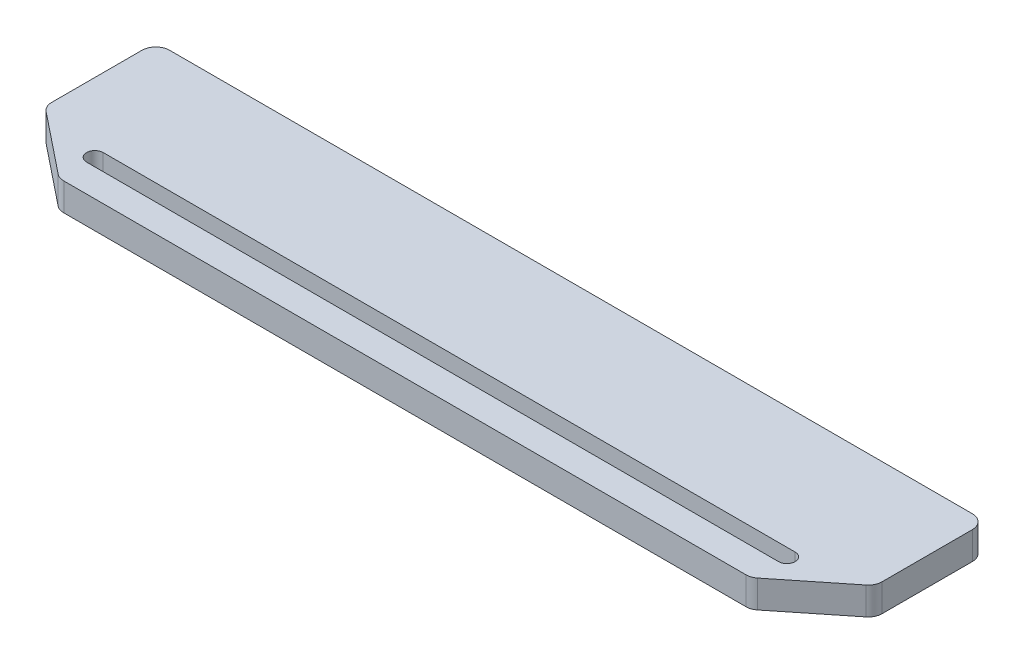
ISO-10303-21;
HEADER;
FILE_DESCRIPTION(('STEP AP214'),'2;1');
FILE_NAME('part.step','',(''),(''),'','','');
FILE_SCHEMA(('AUTOMOTIVE_DESIGN { 1 0 10303 214 1 1 1 1 }'));
ENDSEC;
DATA;
#1=APPLICATION_CONTEXT('core data for automotive mechanical design processes');
#2=APPLICATION_PROTOCOL_DEFINITION('international standard','automotive_design',2000,#1);
#3=PRODUCT_CONTEXT('',#1,'mechanical');
#4=PRODUCT('Part','Part','',(#3));
#5=PRODUCT_RELATED_PRODUCT_CATEGORY('part','',(#4));
#6=PRODUCT_DEFINITION_FORMATION('','',#4);
#7=PRODUCT_DEFINITION_CONTEXT('part definition',#1,'design');
#8=PRODUCT_DEFINITION('design','',#6,#7);
#9=PRODUCT_DEFINITION_SHAPE('','',#8);
#10=(LENGTH_UNIT() NAMED_UNIT(*) SI_UNIT(.MILLI.,.METRE.));
#11=(NAMED_UNIT(*) PLANE_ANGLE_UNIT() SI_UNIT($,.RADIAN.));
#12=(NAMED_UNIT(*) SI_UNIT($,.STERADIAN.) SOLID_ANGLE_UNIT());
#13=UNCERTAINTY_MEASURE_WITH_UNIT(LENGTH_MEASURE(1.E-05),#10,'distance_accuracy_value','');
#14=(GEOMETRIC_REPRESENTATION_CONTEXT(3) GLOBAL_UNCERTAINTY_ASSIGNED_CONTEXT((#13)) GLOBAL_UNIT_ASSIGNED_CONTEXT((#10,
#11,#12)) REPRESENTATION_CONTEXT('',''));
#15=CARTESIAN_POINT('',(0.,0.,0.));
#16=DIRECTION('',(0.,0.,1.));
#17=DIRECTION('',(1.,0.,0.));
#18=AXIS2_PLACEMENT_3D('',#15,#16,#17);
#19=CARTESIAN_POINT('',(295.,10.,5.));
#20=DIRECTION('',(0.,1.,0.));
#21=DIRECTION('',(0.,0.,1.));
#22=AXIS2_PLACEMENT_3D('',#19,#20,#21);
#23=PLANE('',#22);
#24=CARTESIAN_POINT('',(295.,10.,5.));
#25=DIRECTION('',(0.,1.,0.));
#26=DIRECTION('',(0.,0.,1.));
#27=AXIS2_PLACEMENT_3D('',#24,#25,#26);
#28=CIRCLE('',#27,5.);
#29=CARTESIAN_POINT('',(300.,10.,5.00000000000004));
#30=VERTEX_POINT('',#29);
#31=CARTESIAN_POINT('',(295.,10.,0.));
#32=VERTEX_POINT('',#31);
#33=EDGE_CURVE('E171',#30,#32,#28,.T.);
#34=ORIENTED_EDGE('',*,*,#33,.T.);
#35=DIRECTION('',(-1.,0.,0.));
#36=VECTOR('',#35,1.);
#37=CARTESIAN_POINT('',(5.00000000000004,10.,0.));
#38=LINE('',#37,#36);
#39=CARTESIAN_POINT('',(5.,10.,0.));
#40=VERTEX_POINT('',#39);
#41=EDGE_CURVE('E132',#32,#40,#38,.T.);
#42=ORIENTED_EDGE('',*,*,#41,.T.);
#43=CARTESIAN_POINT('',(5.,10.,5.));
#44=DIRECTION('',(0.,1.,0.));
#45=DIRECTION('',(0.,0.,-1.));
#46=AXIS2_PLACEMENT_3D('',#43,#44,#45);
#47=CIRCLE('',#46,5.);
#48=CARTESIAN_POINT('',(0.,10.,5.00000000000004));
#49=VERTEX_POINT('',#48);
#50=EDGE_CURVE('E182',#40,#49,#47,.T.);
#51=ORIENTED_EDGE('',*,*,#50,.T.);
#52=DIRECTION('',(0.,0.,1.));
#53=VECTOR('',#52,1.);
#54=CARTESIAN_POINT('',(0.,10.,5.00000000000004));
#55=LINE('',#54,#53);
#56=CARTESIAN_POINT('',(0.,10.,37.5968757625672));
#57=VERTEX_POINT('',#56);
#58=EDGE_CURVE('E190',#49,#57,#55,.T.);
#59=ORIENTED_EDGE('',*,*,#58,.T.);
#60=CARTESIAN_POINT('',(5.,10.,37.5968757625672));
#61=DIRECTION('',(0.,1.,0.));
#62=DIRECTION('',(0.,0.,-1.));
#63=AXIS2_PLACEMENT_3D('',#60,#61,#62);
#64=CIRCLE('',#63,5.);
#65=CARTESIAN_POINT('',(1.87652476222788,10.,41.5012198097823));
#66=VERTEX_POINT('',#65);
#67=EDGE_CURVE('E192',#57,#66,#64,.T.);
#68=ORIENTED_EDGE('',*,*,#67,.T.);
#69=DIRECTION('',(0.78086880944303,0.,0.624695047554425));
#70=VECTOR('',#69,1.);
#71=CARTESIAN_POINT('',(1.87652476222788,10.,41.5012198097823));
#72=LINE('',#71,#70);
#73=CARTESIAN_POINT('',(23.6304300590189,10.,58.9043440472152));
#74=VERTEX_POINT('',#73);
#75=EDGE_CURVE('E194',#66,#74,#72,.T.);
#76=ORIENTED_EDGE('',*,*,#75,.T.);
#77=CARTESIAN_POINT('',(26.7539052967911,10.,55.));
#78=DIRECTION('',(0.,1.,0.));
#79=DIRECTION('',(0.,0.,1.));
#80=AXIS2_PLACEMENT_3D('',#77,#78,#79);
#81=CIRCLE('',#80,5.);
#82=CARTESIAN_POINT('',(26.7539052967911,10.,60.));
#83=VERTEX_POINT('',#82);
#84=EDGE_CURVE('E196',#74,#83,#81,.T.);
#85=ORIENTED_EDGE('',*,*,#84,.T.);
#86=DIRECTION('',(1.,0.,0.));
#87=VECTOR('',#86,1.);
#88=CARTESIAN_POINT('',(26.7539052967911,10.,60.));
#89=LINE('',#88,#87);
#90=CARTESIAN_POINT('',(273.246094703209,10.,60.));
#91=VERTEX_POINT('',#90);
#92=EDGE_CURVE('E198',#83,#91,#89,.T.);
#93=ORIENTED_EDGE('',*,*,#92,.T.);
#94=CARTESIAN_POINT('',(273.246094703209,10.,55.));
#95=DIRECTION('',(0.,1.,0.));
#96=DIRECTION('',(0.,0.,-1.));
#97=AXIS2_PLACEMENT_3D('',#94,#95,#96);
#98=CIRCLE('',#97,5.);
#99=CARTESIAN_POINT('',(276.369569940981,10.,58.9043440472152));
#100=VERTEX_POINT('',#99);
#101=EDGE_CURVE('E200',#91,#100,#98,.T.);
#102=ORIENTED_EDGE('',*,*,#101,.T.);
#103=DIRECTION('',(0.78086880944303,0.,-0.624695047554424));
#104=VECTOR('',#103,1.);
#105=CARTESIAN_POINT('',(276.369569940981,10.,58.9043440472152));
#106=LINE('',#105,#104);
#107=CARTESIAN_POINT('',(298.123475237772,10.,41.5012198097823));
#108=VERTEX_POINT('',#107);
#109=EDGE_CURVE('E202',#100,#108,#106,.T.);
#110=ORIENTED_EDGE('',*,*,#109,.T.);
#111=CARTESIAN_POINT('',(295.,10.,37.5968757625672));
#112=DIRECTION('',(0.,1.,0.));
#113=DIRECTION('',(0.,0.,-1.));
#114=AXIS2_PLACEMENT_3D('',#111,#112,#113);
#115=CIRCLE('',#114,5.);
#116=CARTESIAN_POINT('',(300.,10.,37.5968757625672));
#117=VERTEX_POINT('',#116);
#118=EDGE_CURVE('E166',#108,#117,#115,.T.);
#119=ORIENTED_EDGE('',*,*,#118,.T.);
#120=DIRECTION('',(0.,0.,-1.));
#121=VECTOR('',#120,1.);
#122=CARTESIAN_POINT('',(300.,10.,5.00000000000004));
#123=LINE('',#122,#121);
#124=EDGE_CURVE('E168',#117,#30,#123,.T.);
#125=ORIENTED_EDGE('',*,*,#124,.T.);
#126=EDGE_LOOP('',(#34,#42,#51,#59,#68,#76,#85,#93,#102,#110,#119,#125));
#127=FACE_BOUND('',#126,.T.);
#128=DIRECTION('',(1.,0.,0.));
#129=VECTOR('',#128,1.);
#130=CARTESIAN_POINT('',(25.,10.,50.));
#131=LINE('',#130,#129);
#132=CARTESIAN_POINT('',(25.,10.,50.));
#133=VERTEX_POINT('',#132);
#134=CARTESIAN_POINT('',(275.,10.,50.));
#135=VERTEX_POINT('',#134);
#136=EDGE_CURVE('E268',#133,#135,#131,.T.);
#137=ORIENTED_EDGE('',*,*,#136,.F.);
#138=CARTESIAN_POINT('',(25.,10.,47.));
#139=DIRECTION('',(0.,1.,0.));
#140=DIRECTION('',(0.,0.,1.));
#141=AXIS2_PLACEMENT_3D('',#138,#139,#140);
#142=CIRCLE('',#141,3.);
#143=CARTESIAN_POINT('',(25.,10.,44.));
#144=VERTEX_POINT('',#143);
#145=EDGE_CURVE('E278',#144,#133,#142,.T.);
#146=ORIENTED_EDGE('',*,*,#145,.F.);
#147=DIRECTION('',(-1.,0.,0.));
#148=VECTOR('',#147,1.);
#149=CARTESIAN_POINT('',(25.,10.,44.));
#150=LINE('',#149,#148);
#151=CARTESIAN_POINT('',(275.,10.,44.));
#152=VERTEX_POINT('',#151);
#153=EDGE_CURVE('E281',#152,#144,#150,.T.);
#154=ORIENTED_EDGE('',*,*,#153,.F.);
#155=CARTESIAN_POINT('',(275.,10.,47.));
#156=DIRECTION('',(0.,1.,0.));
#157=DIRECTION('',(0.,0.,1.));
#158=AXIS2_PLACEMENT_3D('',#155,#156,#157);
#159=CIRCLE('',#158,3.);
#160=EDGE_CURVE('E284',#135,#152,#159,.T.);
#161=ORIENTED_EDGE('',*,*,#160,.F.);
#162=EDGE_LOOP('',(#137,#146,#154,#161));
#163=FACE_BOUND('',#162,.T.);
#164=ADVANCED_FACE('F38',(#127,#163),#23,.T.);
#165=CARTESIAN_POINT('',(295.,0.,5.));
#166=DIRECTION('',(0.,1.,0.));
#167=DIRECTION('',(0.,0.,1.));
#168=AXIS2_PLACEMENT_3D('',#165,#166,#167);
#169=PLANE('',#168);
#170=CARTESIAN_POINT('',(295.,0.,5.));
#171=DIRECTION('',(0.,1.,0.));
#172=DIRECTION('',(0.,0.,1.));
#173=AXIS2_PLACEMENT_3D('',#170,#171,#172);
#174=CIRCLE('',#173,5.);
#175=CARTESIAN_POINT('',(300.,0.,5.00000000000004));
#176=VERTEX_POINT('',#175);
#177=CARTESIAN_POINT('',(295.,0.,0.));
#178=VERTEX_POINT('',#177);
#179=EDGE_CURVE('E205',#176,#178,#174,.T.);
#180=ORIENTED_EDGE('',*,*,#179,.F.);
#181=DIRECTION('',(0.,0.,-1.));
#182=VECTOR('',#181,1.);
#183=CARTESIAN_POINT('',(300.,0.,5.00000000000004));
#184=LINE('',#183,#182);
#185=CARTESIAN_POINT('',(300.,0.,37.5968757625672));
#186=VERTEX_POINT('',#185);
#187=EDGE_CURVE('E124',#186,#176,#184,.T.);
#188=ORIENTED_EDGE('',*,*,#187,.F.);
#189=CARTESIAN_POINT('',(295.,0.,37.5968757625672));
#190=DIRECTION('',(0.,1.,0.));
#191=DIRECTION('',(0.,0.,-1.));
#192=AXIS2_PLACEMENT_3D('',#189,#190,#191);
#193=CIRCLE('',#192,5.);
#194=CARTESIAN_POINT('',(298.123475237772,0.,41.5012198097823));
#195=VERTEX_POINT('',#194);
#196=EDGE_CURVE('E117',#195,#186,#193,.T.);
#197=ORIENTED_EDGE('',*,*,#196,.F.);
#198=DIRECTION('',(0.78086880944303,0.,-0.624695047554424));
#199=VECTOR('',#198,1.);
#200=CARTESIAN_POINT('',(276.369569940981,0.,58.9043440472152));
#201=LINE('',#200,#199);
#202=CARTESIAN_POINT('',(276.369569940981,0.,58.9043440472152));
#203=VERTEX_POINT('',#202);
#204=EDGE_CURVE('E223',#203,#195,#201,.T.);
#205=ORIENTED_EDGE('',*,*,#204,.F.);
#206=CARTESIAN_POINT('',(273.246094703209,0.,55.));
#207=DIRECTION('',(0.,1.,0.));
#208=DIRECTION('',(0.,0.,-1.));
#209=AXIS2_PLACEMENT_3D('',#206,#207,#208);
#210=CIRCLE('',#209,5.);
#211=CARTESIAN_POINT('',(273.246094703209,0.,60.));
#212=VERTEX_POINT('',#211);
#213=EDGE_CURVE('E221',#212,#203,#210,.T.);
#214=ORIENTED_EDGE('',*,*,#213,.F.);
#215=DIRECTION('',(1.,0.,0.));
#216=VECTOR('',#215,1.);
#217=CARTESIAN_POINT('',(26.7539052967911,0.,60.));
#218=LINE('',#217,#216);
#219=CARTESIAN_POINT('',(26.7539052967911,0.,60.));
#220=VERTEX_POINT('',#219);
#221=EDGE_CURVE('E219',#220,#212,#218,.T.);
#222=ORIENTED_EDGE('',*,*,#221,.F.);
#223=CARTESIAN_POINT('',(26.7539052967911,0.,55.));
#224=DIRECTION('',(0.,1.,0.));
#225=DIRECTION('',(0.,0.,1.));
#226=AXIS2_PLACEMENT_3D('',#223,#224,#225);
#227=CIRCLE('',#226,5.);
#228=CARTESIAN_POINT('',(23.6304300590189,0.,58.9043440472152));
#229=VERTEX_POINT('',#228);
#230=EDGE_CURVE('E217',#229,#220,#227,.T.);
#231=ORIENTED_EDGE('',*,*,#230,.F.);
#232=DIRECTION('',(0.78086880944303,0.,0.624695047554425));
#233=VECTOR('',#232,1.);
#234=CARTESIAN_POINT('',(1.87652476222788,0.,41.5012198097823));
#235=LINE('',#234,#233);
#236=CARTESIAN_POINT('',(1.87652476222788,0.,41.5012198097823));
#237=VERTEX_POINT('',#236);
#238=EDGE_CURVE('E215',#237,#229,#235,.T.);
#239=ORIENTED_EDGE('',*,*,#238,.F.);
#240=CARTESIAN_POINT('',(5.,0.,37.5968757625672));
#241=DIRECTION('',(0.,1.,0.));
#242=DIRECTION('',(0.,0.,-1.));
#243=AXIS2_PLACEMENT_3D('',#240,#241,#242);
#244=CIRCLE('',#243,5.);
#245=CARTESIAN_POINT('',(0.,0.,37.5968757625672));
#246=VERTEX_POINT('',#245);
#247=EDGE_CURVE('E213',#246,#237,#244,.T.);
#248=ORIENTED_EDGE('',*,*,#247,.F.);
#249=DIRECTION('',(0.,0.,1.));
#250=VECTOR('',#249,1.);
#251=CARTESIAN_POINT('',(0.,0.,5.00000000000004));
#252=LINE('',#251,#250);
#253=CARTESIAN_POINT('',(0.,0.,5.00000000000004));
#254=VERTEX_POINT('',#253);
#255=EDGE_CURVE('E211',#254,#246,#252,.T.);
#256=ORIENTED_EDGE('',*,*,#255,.F.);
#257=CARTESIAN_POINT('',(5.,0.,5.));
#258=DIRECTION('',(0.,1.,0.));
#259=DIRECTION('',(0.,0.,-1.));
#260=AXIS2_PLACEMENT_3D('',#257,#258,#259);
#261=CIRCLE('',#260,5.);
#262=CARTESIAN_POINT('',(5.,0.,0.));
#263=VERTEX_POINT('',#262);
#264=EDGE_CURVE('E209',#263,#254,#261,.T.);
#265=ORIENTED_EDGE('',*,*,#264,.F.);
#266=DIRECTION('',(-1.,0.,0.));
#267=VECTOR('',#266,1.);
#268=CARTESIAN_POINT('',(5.00000000000004,0.,0.));
#269=LINE('',#268,#267);
#270=EDGE_CURVE('E82',#178,#263,#269,.T.);
#271=ORIENTED_EDGE('',*,*,#270,.F.);
#272=EDGE_LOOP('',(#180,#188,#197,#205,#214,#222,#231,#239,#248,#256,#265,#271));
#273=FACE_BOUND('',#272,.T.);
#274=CARTESIAN_POINT('',(25.,0.,47.));
#275=DIRECTION('',(0.,-1.,0.));
#276=DIRECTION('',(0.,0.,-1.));
#277=AXIS2_PLACEMENT_3D('',#274,#275,#276);
#278=CIRCLE('',#277,3.);
#279=CARTESIAN_POINT('',(25.,0.,50.));
#280=VERTEX_POINT('',#279);
#281=CARTESIAN_POINT('',(25.,0.,44.));
#282=VERTEX_POINT('',#281);
#283=EDGE_CURVE('E11',#280,#282,#278,.T.);
#284=ORIENTED_EDGE('',*,*,#283,.F.);
#285=DIRECTION('',(-1.,0.,0.));
#286=VECTOR('',#285,1.);
#287=CARTESIAN_POINT('',(25.,0.,50.));
#288=LINE('',#287,#286);
#289=CARTESIAN_POINT('',(275.,0.,50.));
#290=VERTEX_POINT('',#289);
#291=EDGE_CURVE('E47',#290,#280,#288,.T.);
#292=ORIENTED_EDGE('',*,*,#291,.F.);
#293=CARTESIAN_POINT('',(275.,0.,47.));
#294=DIRECTION('',(0.,-1.,0.));
#295=DIRECTION('',(0.,0.,-1.));
#296=AXIS2_PLACEMENT_3D('',#293,#294,#295);
#297=CIRCLE('',#296,3.);
#298=CARTESIAN_POINT('',(275.,0.,44.));
#299=VERTEX_POINT('',#298);
#300=EDGE_CURVE('E256',#299,#290,#297,.T.);
#301=ORIENTED_EDGE('',*,*,#300,.F.);
#302=DIRECTION('',(1.,0.,0.));
#303=VECTOR('',#302,1.);
#304=CARTESIAN_POINT('',(25.,0.,44.));
#305=LINE('',#304,#303);
#306=EDGE_CURVE('E254',#282,#299,#305,.T.);
#307=ORIENTED_EDGE('',*,*,#306,.F.);
#308=EDGE_LOOP('',(#284,#292,#301,#307));
#309=FACE_BOUND('',#308,.T.);
#310=ADVANCED_FACE('F270',(#273,#309),#169,.F.);
#311=CARTESIAN_POINT('',(295.,10.,5.));
#312=DIRECTION('',(0.,-1.,0.));
#313=DIRECTION('',(0.,0.,-1.));
#314=AXIS2_PLACEMENT_3D('',#311,#312,#313);
#315=CYLINDRICAL_SURFACE('',#314,5.);
#316=ORIENTED_EDGE('',*,*,#179,.T.);
#317=DIRECTION('',(0.,-1.,0.));
#318=VECTOR('',#317,1.);
#319=CARTESIAN_POINT('',(295.,10.,0.));
#320=LINE('',#319,#318);
#321=EDGE_CURVE('E180',#32,#178,#320,.T.);
#322=ORIENTED_EDGE('',*,*,#321,.F.);
#323=ORIENTED_EDGE('',*,*,#33,.F.);
#324=DIRECTION('',(0.,-1.,0.));
#325=VECTOR('',#324,1.);
#326=CARTESIAN_POINT('',(300.,10.,5.00000000000004));
#327=LINE('',#326,#325);
#328=EDGE_CURVE('E173',#30,#176,#327,.T.);
#329=ORIENTED_EDGE('',*,*,#328,.T.);
#330=EDGE_LOOP('',(#316,#322,#323,#329));
#331=FACE_BOUND('',#330,.T.);
#332=ADVANCED_FACE('F40',(#331),#315,.T.);
#333=CARTESIAN_POINT('',(5.00000000000004,10.,0.));
#334=DIRECTION('',(0.,0.,1.));
#335=DIRECTION('',(1.,0.,0.));
#336=AXIS2_PLACEMENT_3D('',#333,#334,#335);
#337=PLANE('',#336);
#338=ORIENTED_EDGE('',*,*,#270,.T.);
#339=DIRECTION('',(0.,-1.,0.));
#340=VECTOR('',#339,1.);
#341=CARTESIAN_POINT('',(5.,10.,0.));
#342=LINE('',#341,#340);
#343=EDGE_CURVE('E250',#40,#263,#342,.T.);
#344=ORIENTED_EDGE('',*,*,#343,.F.);
#345=ORIENTED_EDGE('',*,*,#41,.F.);
#346=ORIENTED_EDGE('',*,*,#321,.T.);
#347=EDGE_LOOP('',(#338,#344,#345,#346));
#348=FACE_BOUND('',#347,.T.);
#349=ADVANCED_FACE('F340',(#348),#337,.F.);
#350=CARTESIAN_POINT('',(5.,10.,5.));
#351=DIRECTION('',(0.,-1.,0.));
#352=DIRECTION('',(0.,0.,-1.));
#353=AXIS2_PLACEMENT_3D('',#350,#351,#352);
#354=CYLINDRICAL_SURFACE('',#353,5.);
#355=ORIENTED_EDGE('',*,*,#264,.T.);
#356=DIRECTION('',(0.,-1.,0.));
#357=VECTOR('',#356,1.);
#358=CARTESIAN_POINT('',(0.,10.,5.00000000000004));
#359=LINE('',#358,#357);
#360=EDGE_CURVE('E247',#49,#254,#359,.T.);
#361=ORIENTED_EDGE('',*,*,#360,.F.);
#362=ORIENTED_EDGE('',*,*,#50,.F.);
#363=ORIENTED_EDGE('',*,*,#343,.T.);
#364=EDGE_LOOP('',(#355,#361,#362,#363));
#365=FACE_BOUND('',#364,.T.);
#366=ADVANCED_FACE('F337',(#365),#354,.T.);
#367=CARTESIAN_POINT('',(0.,10.,5.00000000000004));
#368=DIRECTION('',(1.,0.,0.));
#369=DIRECTION('',(0.,0.,-1.));
#370=AXIS2_PLACEMENT_3D('',#367,#368,#369);
#371=PLANE('',#370);
#372=ORIENTED_EDGE('',*,*,#255,.T.);
#373=DIRECTION('',(0.,-1.,0.));
#374=VECTOR('',#373,1.);
#375=CARTESIAN_POINT('',(0.,10.,37.5968757625672));
#376=LINE('',#375,#374);
#377=EDGE_CURVE('E244',#57,#246,#376,.T.);
#378=ORIENTED_EDGE('',*,*,#377,.F.);
#379=ORIENTED_EDGE('',*,*,#58,.F.);
#380=ORIENTED_EDGE('',*,*,#360,.T.);
#381=EDGE_LOOP('',(#372,#378,#379,#380));
#382=FACE_BOUND('',#381,.T.);
#383=ADVANCED_FACE('F333',(#382),#371,.F.);
#384=CARTESIAN_POINT('',(5.,10.,37.5968757625672));
#385=DIRECTION('',(0.,-1.,0.));
#386=DIRECTION('',(0.,0.,-1.));
#387=AXIS2_PLACEMENT_3D('',#384,#385,#386);
#388=CYLINDRICAL_SURFACE('',#387,5.);
#389=ORIENTED_EDGE('',*,*,#247,.T.);
#390=DIRECTION('',(0.,-1.,0.));
#391=VECTOR('',#390,1.);
#392=CARTESIAN_POINT('',(1.87652476222788,10.,41.5012198097823));
#393=LINE('',#392,#391);
#394=EDGE_CURVE('E241',#66,#237,#393,.T.);
#395=ORIENTED_EDGE('',*,*,#394,.F.);
#396=ORIENTED_EDGE('',*,*,#67,.F.);
#397=ORIENTED_EDGE('',*,*,#377,.T.);
#398=EDGE_LOOP('',(#389,#395,#396,#397));
#399=FACE_BOUND('',#398,.T.);
#400=ADVANCED_FACE('F329',(#399),#388,.T.);
#401=CARTESIAN_POINT('',(1.87652476222788,10.,41.5012198097823));
#402=DIRECTION('',(0.624695047554425,0.,-0.78086880944303));
#403=DIRECTION('',(-0.78086880944303,0.,-0.624695047554425));
#404=AXIS2_PLACEMENT_3D('',#401,#402,#403);
#405=PLANE('',#404);
#406=ORIENTED_EDGE('',*,*,#238,.T.);
#407=DIRECTION('',(0.,-1.,0.));
#408=VECTOR('',#407,1.);
#409=CARTESIAN_POINT('',(23.6304300590189,10.,58.9043440472152));
#410=LINE('',#409,#408);
#411=EDGE_CURVE('E238',#74,#229,#410,.T.);
#412=ORIENTED_EDGE('',*,*,#411,.F.);
#413=ORIENTED_EDGE('',*,*,#75,.F.);
#414=ORIENTED_EDGE('',*,*,#394,.T.);
#415=EDGE_LOOP('',(#406,#412,#413,#414));
#416=FACE_BOUND('',#415,.T.);
#417=ADVANCED_FACE('F325',(#416),#405,.F.);
#418=CARTESIAN_POINT('',(26.7539052967911,10.,55.));
#419=DIRECTION('',(0.,-1.,0.));
#420=DIRECTION('',(0.,0.,-1.));
#421=AXIS2_PLACEMENT_3D('',#418,#419,#420);
#422=CYLINDRICAL_SURFACE('',#421,5.);
#423=ORIENTED_EDGE('',*,*,#230,.T.);
#424=DIRECTION('',(0.,-1.,0.));
#425=VECTOR('',#424,1.);
#426=CARTESIAN_POINT('',(26.7539052967911,10.,60.));
#427=LINE('',#426,#425);
#428=EDGE_CURVE('E235',#83,#220,#427,.T.);
#429=ORIENTED_EDGE('',*,*,#428,.F.);
#430=ORIENTED_EDGE('',*,*,#84,.F.);
#431=ORIENTED_EDGE('',*,*,#411,.T.);
#432=EDGE_LOOP('',(#423,#429,#430,#431));
#433=FACE_BOUND('',#432,.T.);
#434=ADVANCED_FACE('F321',(#433),#422,.T.);
#435=CARTESIAN_POINT('',(26.7539052967911,10.,60.));
#436=DIRECTION('',(0.,0.,-1.));
#437=DIRECTION('',(-1.,0.,0.));
#438=AXIS2_PLACEMENT_3D('',#435,#436,#437);
#439=PLANE('',#438);
#440=ORIENTED_EDGE('',*,*,#221,.T.);
#441=DIRECTION('',(0.,-1.,0.));
#442=VECTOR('',#441,1.);
#443=CARTESIAN_POINT('',(273.246094703209,10.,60.));
#444=LINE('',#443,#442);
#445=EDGE_CURVE('E232',#91,#212,#444,.T.);
#446=ORIENTED_EDGE('',*,*,#445,.F.);
#447=ORIENTED_EDGE('',*,*,#92,.F.);
#448=ORIENTED_EDGE('',*,*,#428,.T.);
#449=EDGE_LOOP('',(#440,#446,#447,#448));
#450=FACE_BOUND('',#449,.T.);
#451=ADVANCED_FACE('F317',(#450),#439,.F.);
#452=CARTESIAN_POINT('',(273.246094703209,10.,55.));
#453=DIRECTION('',(0.,-1.,0.));
#454=DIRECTION('',(0.,0.,-1.));
#455=AXIS2_PLACEMENT_3D('',#452,#453,#454);
#456=CYLINDRICAL_SURFACE('',#455,5.);
#457=ORIENTED_EDGE('',*,*,#213,.T.);
#458=DIRECTION('',(0.,-1.,0.));
#459=VECTOR('',#458,1.);
#460=CARTESIAN_POINT('',(276.369569940981,10.,58.9043440472152));
#461=LINE('',#460,#459);
#462=EDGE_CURVE('E229',#100,#203,#461,.T.);
#463=ORIENTED_EDGE('',*,*,#462,.F.);
#464=ORIENTED_EDGE('',*,*,#101,.F.);
#465=ORIENTED_EDGE('',*,*,#445,.T.);
#466=EDGE_LOOP('',(#457,#463,#464,#465));
#467=FACE_BOUND('',#466,.T.);
#468=ADVANCED_FACE('F313',(#467),#456,.T.);
#469=CARTESIAN_POINT('',(276.369569940981,10.,58.9043440472152));
#470=DIRECTION('',(-0.624695047554424,0.,-0.78086880944303));
#471=DIRECTION('',(-0.78086880944303,0.,0.624695047554424));
#472=AXIS2_PLACEMENT_3D('',#469,#470,#471);
#473=PLANE('',#472);
#474=ORIENTED_EDGE('',*,*,#204,.T.);
#475=DIRECTION('',(0.,-1.,0.));
#476=VECTOR('',#475,1.);
#477=CARTESIAN_POINT('',(298.123475237772,10.,41.5012198097823));
#478=LINE('',#477,#476);
#479=EDGE_CURVE('E227',#108,#195,#478,.T.);
#480=ORIENTED_EDGE('',*,*,#479,.F.);
#481=ORIENTED_EDGE('',*,*,#109,.F.);
#482=ORIENTED_EDGE('',*,*,#462,.T.);
#483=EDGE_LOOP('',(#474,#480,#481,#482));
#484=FACE_BOUND('',#483,.T.);
#485=ADVANCED_FACE('F310',(#484),#473,.F.);
#486=CARTESIAN_POINT('',(295.,10.,37.5968757625672));
#487=DIRECTION('',(0.,-1.,0.));
#488=DIRECTION('',(0.,0.,-1.));
#489=AXIS2_PLACEMENT_3D('',#486,#487,#488);
#490=CYLINDRICAL_SURFACE('',#489,5.);
#491=ORIENTED_EDGE('',*,*,#196,.T.);
#492=DIRECTION('',(0.,-1.,0.));
#493=VECTOR('',#492,1.);
#494=CARTESIAN_POINT('',(300.,10.,37.5968757625672));
#495=LINE('',#494,#493);
#496=EDGE_CURVE('E178',#117,#186,#495,.T.);
#497=ORIENTED_EDGE('',*,*,#496,.F.);
#498=ORIENTED_EDGE('',*,*,#118,.F.);
#499=ORIENTED_EDGE('',*,*,#479,.T.);
#500=EDGE_LOOP('',(#491,#497,#498,#499));
#501=FACE_BOUND('',#500,.T.);
#502=ADVANCED_FACE('F307',(#501),#490,.T.);
#503=CARTESIAN_POINT('',(300.,10.,5.00000000000004));
#504=DIRECTION('',(-1.,0.,0.));
#505=DIRECTION('',(0.,0.,1.));
#506=AXIS2_PLACEMENT_3D('',#503,#504,#505);
#507=PLANE('',#506);
#508=ORIENTED_EDGE('',*,*,#187,.T.);
#509=ORIENTED_EDGE('',*,*,#328,.F.);
#510=ORIENTED_EDGE('',*,*,#124,.F.);
#511=ORIENTED_EDGE('',*,*,#496,.T.);
#512=EDGE_LOOP('',(#508,#509,#510,#511));
#513=FACE_BOUND('',#512,.T.);
#514=ADVANCED_FACE('F175',(#513),#507,.F.);
#515=CARTESIAN_POINT('',(25.,10.,47.));
#516=DIRECTION('',(0.,-1.,0.));
#517=DIRECTION('',(0.,0.,-1.));
#518=AXIS2_PLACEMENT_3D('',#515,#516,#517);
#519=CYLINDRICAL_SURFACE('',#518,3.);
#520=ORIENTED_EDGE('',*,*,#283,.T.);
#521=DIRECTION('',(0.,-1.,0.));
#522=VECTOR('',#521,1.);
#523=CARTESIAN_POINT('',(25.,10.,44.));
#524=LINE('',#523,#522);
#525=EDGE_CURVE('E275',#144,#282,#524,.T.);
#526=ORIENTED_EDGE('',*,*,#525,.F.);
#527=ORIENTED_EDGE('',*,*,#145,.T.);
#528=DIRECTION('',(0.,-1.,0.));
#529=VECTOR('',#528,1.);
#530=CARTESIAN_POINT('',(25.,10.,50.));
#531=LINE('',#530,#529);
#532=EDGE_CURVE('E207',#133,#280,#531,.T.);
#533=ORIENTED_EDGE('',*,*,#532,.T.);
#534=EDGE_LOOP('',(#520,#526,#527,#533));
#535=FACE_BOUND('',#534,.T.);
#536=ADVANCED_FACE('F273',(#535),#519,.F.);
#537=CARTESIAN_POINT('',(25.,10.,50.));
#538=DIRECTION('',(0.,0.,-1.));
#539=DIRECTION('',(-1.,0.,0.));
#540=AXIS2_PLACEMENT_3D('',#537,#538,#539);
#541=PLANE('',#540);
#542=ORIENTED_EDGE('',*,*,#291,.T.);
#543=ORIENTED_EDGE('',*,*,#532,.F.);
#544=ORIENTED_EDGE('',*,*,#136,.T.);
#545=DIRECTION('',(0.,-1.,0.));
#546=VECTOR('',#545,1.);
#547=CARTESIAN_POINT('',(275.,10.,50.));
#548=LINE('',#547,#546);
#549=EDGE_CURVE('E186',#135,#290,#548,.T.);
#550=ORIENTED_EDGE('',*,*,#549,.T.);
#551=EDGE_LOOP('',(#542,#543,#544,#550));
#552=FACE_BOUND('',#551,.T.);
#553=ADVANCED_FACE('F266',(#552),#541,.T.);
#554=CARTESIAN_POINT('',(275.,10.,47.));
#555=DIRECTION('',(0.,-1.,0.));
#556=DIRECTION('',(0.,0.,-1.));
#557=AXIS2_PLACEMENT_3D('',#554,#555,#556);
#558=CYLINDRICAL_SURFACE('',#557,3.);
#559=ORIENTED_EDGE('',*,*,#300,.T.);
#560=ORIENTED_EDGE('',*,*,#549,.F.);
#561=ORIENTED_EDGE('',*,*,#160,.T.);
#562=DIRECTION('',(0.,-1.,0.));
#563=VECTOR('',#562,1.);
#564=CARTESIAN_POINT('',(275.,10.,44.));
#565=LINE('',#564,#563);
#566=EDGE_CURVE('E54',#152,#299,#565,.T.);
#567=ORIENTED_EDGE('',*,*,#566,.T.);
#568=EDGE_LOOP('',(#559,#560,#561,#567));
#569=FACE_BOUND('',#568,.T.);
#570=ADVANCED_FACE('F260',(#569),#558,.F.);
#571=CARTESIAN_POINT('',(25.,10.,44.));
#572=DIRECTION('',(0.,0.,1.));
#573=DIRECTION('',(1.,0.,0.));
#574=AXIS2_PLACEMENT_3D('',#571,#572,#573);
#575=PLANE('',#574);
#576=ORIENTED_EDGE('',*,*,#306,.T.);
#577=ORIENTED_EDGE('',*,*,#566,.F.);
#578=ORIENTED_EDGE('',*,*,#153,.T.);
#579=ORIENTED_EDGE('',*,*,#525,.T.);
#580=EDGE_LOOP('',(#576,#577,#578,#579));
#581=FACE_BOUND('',#580,.T.);
#582=ADVANCED_FACE('F288',(#581),#575,.T.);
#583=CLOSED_SHELL('',(#164,#310,#332,#349,#366,#383,#400,#417,#434,#451,#468,#485,#502,#514,
#536,#553,#570,#582));
#584=MANIFOLD_SOLID_BREP('B2',#583);
#585=ADVANCED_BREP_SHAPE_REPRESENTATION('',(#18,#584),#14);
#586=SHAPE_DEFINITION_REPRESENTATION(#9,#585);
ENDSEC;
END-ISO-10303-21;
